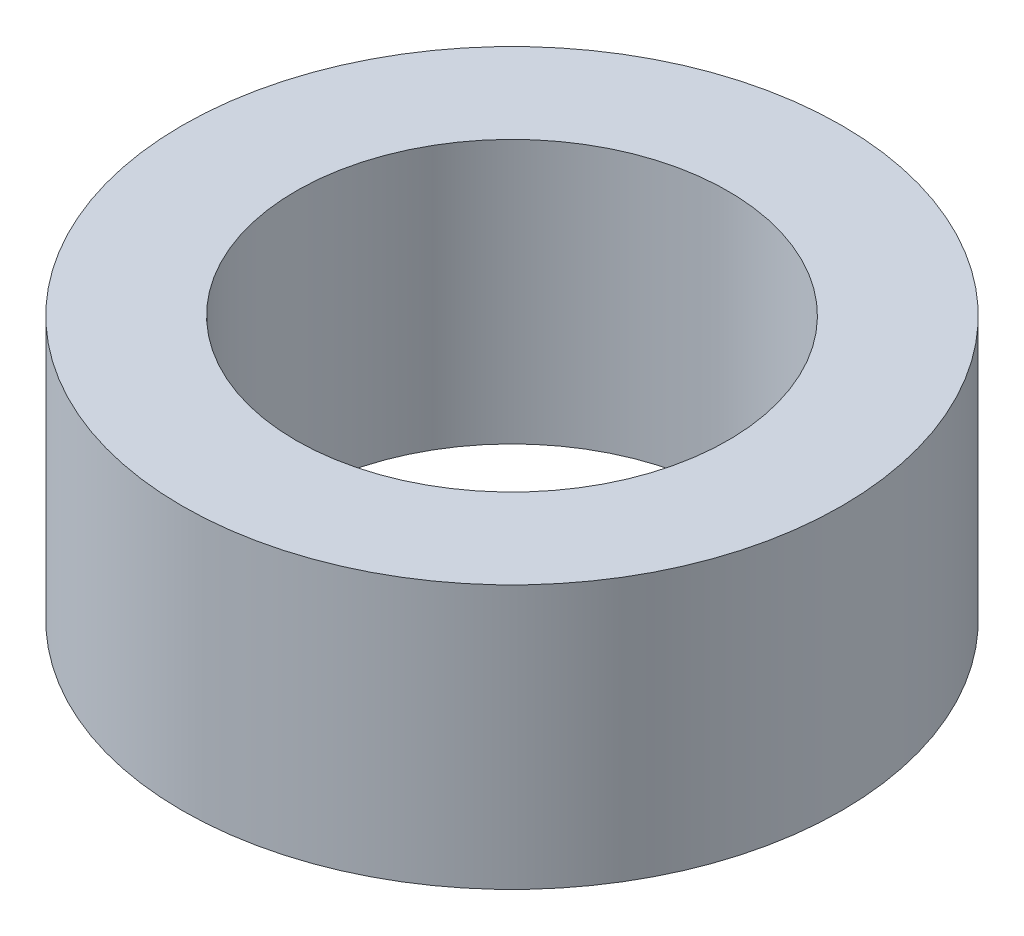
ISO-10303-21;
HEADER;
FILE_DESCRIPTION(('STEP AP214'),'2;1');
FILE_NAME('part.step','',(''),(''),'','','');
FILE_SCHEMA(('AUTOMOTIVE_DESIGN { 1 0 10303 214 1 1 1 1 }'));
ENDSEC;
DATA;
#1=APPLICATION_CONTEXT('core data for automotive mechanical design processes');
#2=APPLICATION_PROTOCOL_DEFINITION('international standard','automotive_design',2000,#1);
#3=PRODUCT_CONTEXT('',#1,'mechanical');
#4=PRODUCT('Part','Part','',(#3));
#5=PRODUCT_RELATED_PRODUCT_CATEGORY('part','',(#4));
#6=PRODUCT_DEFINITION_FORMATION('','',#4);
#7=PRODUCT_DEFINITION_CONTEXT('part definition',#1,'design');
#8=PRODUCT_DEFINITION('design','',#6,#7);
#9=PRODUCT_DEFINITION_SHAPE('','',#8);
#10=(LENGTH_UNIT() NAMED_UNIT(*) SI_UNIT(.MILLI.,.METRE.));
#11=(NAMED_UNIT(*) PLANE_ANGLE_UNIT() SI_UNIT($,.RADIAN.));
#12=(NAMED_UNIT(*) SI_UNIT($,.STERADIAN.) SOLID_ANGLE_UNIT());
#13=UNCERTAINTY_MEASURE_WITH_UNIT(LENGTH_MEASURE(1.E-05),#10,'distance_accuracy_value','');
#14=(GEOMETRIC_REPRESENTATION_CONTEXT(3) GLOBAL_UNCERTAINTY_ASSIGNED_CONTEXT((#13)) GLOBAL_UNIT_ASSIGNED_CONTEXT((#10,
#11,#12)) REPRESENTATION_CONTEXT('',''));
#15=CARTESIAN_POINT('',(0.,0.,0.));
#16=DIRECTION('',(0.,0.,1.));
#17=DIRECTION('',(1.,0.,0.));
#18=AXIS2_PLACEMENT_3D('',#15,#16,#17);
#19=CARTESIAN_POINT('',(0.,3.175,0.));
#20=DIRECTION('',(0.,1.,0.));
#21=DIRECTION('',(0.,0.,1.));
#22=AXIS2_PLACEMENT_3D('',#19,#20,#21);
#23=PLANE('',#22);
#24=CARTESIAN_POINT('',(0.,3.175,0.));
#25=DIRECTION('',(0.,1.,0.));
#26=DIRECTION('',(0.,0.,1.));
#27=AXIS2_PLACEMENT_3D('',#24,#25,#26);
#28=CIRCLE('',#27,3.96875);
#29=CARTESIAN_POINT('',(0.,3.175,3.96875));
#30=VERTEX_POINT('',#29);
#31=EDGE_CURVE('E10',#30,#30,#28,.T.);
#32=ORIENTED_EDGE('',*,*,#31,.T.);
#33=EDGE_LOOP('',(#32));
#34=FACE_BOUND('',#33,.T.);
#35=CARTESIAN_POINT('',(0.,3.175,0.));
#36=DIRECTION('',(0.,1.,0.));
#37=DIRECTION('',(0.,0.,1.));
#38=AXIS2_PLACEMENT_3D('',#35,#36,#37);
#39=CIRCLE('',#38,2.6);
#40=CARTESIAN_POINT('',(0.,3.175,2.6));
#41=VERTEX_POINT('',#40);
#42=EDGE_CURVE('E47',#41,#41,#39,.T.);
#43=ORIENTED_EDGE('',*,*,#42,.F.);
#44=EDGE_LOOP('',(#43));
#45=FACE_BOUND('',#44,.T.);
#46=ADVANCED_FACE('F36',(#34,#45),#23,.T.);
#47=CARTESIAN_POINT('',(0.,0.,0.));
#48=DIRECTION('',(0.,1.,0.));
#49=DIRECTION('',(0.,0.,1.));
#50=AXIS2_PLACEMENT_3D('',#47,#48,#49);
#51=PLANE('',#50);
#52=CARTESIAN_POINT('',(0.,0.,0.));
#53=DIRECTION('',(0.,1.,0.));
#54=DIRECTION('',(0.,0.,1.));
#55=AXIS2_PLACEMENT_3D('',#52,#53,#54);
#56=CIRCLE('',#55,3.96875);
#57=CARTESIAN_POINT('',(0.,0.,3.96875));
#58=VERTEX_POINT('',#57);
#59=EDGE_CURVE('E40',#58,#58,#56,.T.);
#60=ORIENTED_EDGE('',*,*,#59,.F.);
#61=EDGE_LOOP('',(#60));
#62=FACE_BOUND('',#61,.T.);
#63=CARTESIAN_POINT('',(0.,0.,0.));
#64=DIRECTION('',(0.,1.,0.));
#65=DIRECTION('',(0.,0.,1.));
#66=AXIS2_PLACEMENT_3D('',#63,#64,#65);
#67=CIRCLE('',#66,2.6);
#68=CARTESIAN_POINT('',(0.,0.,2.6));
#69=VERTEX_POINT('',#68);
#70=EDGE_CURVE('E49',#69,#69,#67,.T.);
#71=ORIENTED_EDGE('',*,*,#70,.T.);
#72=EDGE_LOOP('',(#71));
#73=FACE_BOUND('',#72,.T.);
#74=ADVANCED_FACE('F59',(#62,#73),#51,.F.);
#75=CARTESIAN_POINT('',(0.,3.175,0.));
#76=DIRECTION('',(0.,-1.,0.));
#77=DIRECTION('',(0.,0.,-1.));
#78=AXIS2_PLACEMENT_3D('',#75,#76,#77);
#79=CYLINDRICAL_SURFACE('',#78,3.96875);
#80=ORIENTED_EDGE('',*,*,#31,.F.);
#81=EDGE_LOOP('',(#80));
#82=FACE_BOUND('',#81,.T.);
#83=ORIENTED_EDGE('',*,*,#59,.T.);
#84=EDGE_LOOP('',(#83));
#85=FACE_BOUND('',#84,.T.);
#86=ADVANCED_FACE('F38',(#82,#85),#79,.T.);
#87=CARTESIAN_POINT('',(0.,3.175,0.));
#88=DIRECTION('',(0.,-1.,0.));
#89=DIRECTION('',(0.,0.,-1.));
#90=AXIS2_PLACEMENT_3D('',#87,#88,#89);
#91=CYLINDRICAL_SURFACE('',#90,2.6);
#92=ORIENTED_EDGE('',*,*,#42,.T.);
#93=EDGE_LOOP('',(#92));
#94=FACE_BOUND('',#93,.T.);
#95=ORIENTED_EDGE('',*,*,#70,.F.);
#96=EDGE_LOOP('',(#95));
#97=FACE_BOUND('',#96,.T.);
#98=ADVANCED_FACE('F55',(#94,#97),#91,.F.);
#99=CLOSED_SHELL('',(#46,#74,#86,#98));
#100=MANIFOLD_SOLID_BREP('B2',#99);
#101=ADVANCED_BREP_SHAPE_REPRESENTATION('',(#18,#100),#14);
#102=SHAPE_DEFINITION_REPRESENTATION(#9,#101);
ENDSEC;
END-ISO-10303-21;
